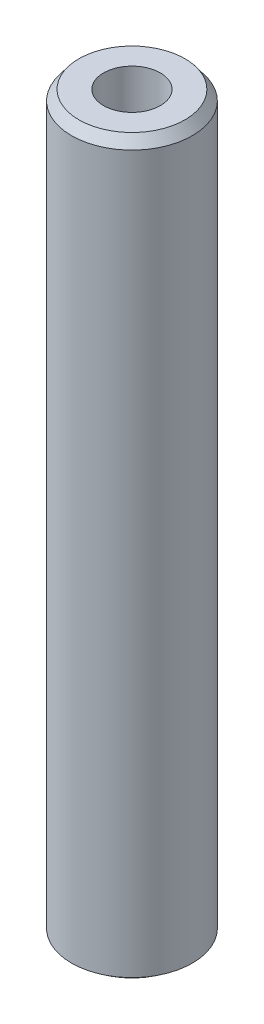
ISO-10303-21;
HEADER;
FILE_DESCRIPTION(('STEP AP214'),'2;1');
FILE_NAME('part.step','',(''),(''),'','','');
FILE_SCHEMA(('AUTOMOTIVE_DESIGN { 1 0 10303 214 1 1 1 1 }'));
ENDSEC;
DATA;
#1=APPLICATION_CONTEXT('core data for automotive mechanical design processes');
#2=APPLICATION_PROTOCOL_DEFINITION('international standard','automotive_design',2000,#1);
#3=PRODUCT_CONTEXT('',#1,'mechanical');
#4=PRODUCT('Part','Part','',(#3));
#5=PRODUCT_RELATED_PRODUCT_CATEGORY('part','',(#4));
#6=PRODUCT_DEFINITION_FORMATION('','',#4);
#7=PRODUCT_DEFINITION_CONTEXT('part definition',#1,'design');
#8=PRODUCT_DEFINITION('design','',#6,#7);
#9=PRODUCT_DEFINITION_SHAPE('','',#8);
#10=(LENGTH_UNIT() NAMED_UNIT(*) SI_UNIT(.MILLI.,.METRE.));
#11=(NAMED_UNIT(*) PLANE_ANGLE_UNIT() SI_UNIT($,.RADIAN.));
#12=(NAMED_UNIT(*) SI_UNIT($,.STERADIAN.) SOLID_ANGLE_UNIT());
#13=UNCERTAINTY_MEASURE_WITH_UNIT(LENGTH_MEASURE(1.E-05),#10,'distance_accuracy_value','');
#14=(GEOMETRIC_REPRESENTATION_CONTEXT(3) GLOBAL_UNCERTAINTY_ASSIGNED_CONTEXT((#13)) GLOBAL_UNIT_ASSIGNED_CONTEXT((#10,
#11,#12)) REPRESENTATION_CONTEXT('',''));
#15=CARTESIAN_POINT('',(0.,0.,0.));
#16=DIRECTION('',(0.,0.,1.));
#17=DIRECTION('',(1.,0.,0.));
#18=AXIS2_PLACEMENT_3D('',#15,#16,#17);
#19=CARTESIAN_POINT('',(0.,303.762270211215,0.));
#20=DIRECTION('',(0.,-1.,0.));
#21=DIRECTION('',(0.,0.,-1.));
#22=AXIS2_PLACEMENT_3D('',#19,#20,#21);
#23=CYLINDRICAL_SURFACE('',#22,25.);
#24=CARTESIAN_POINT('',(0.,299.621065124725,0.));
#25=DIRECTION('',(0.,1.,0.));
#26=DIRECTION('',(0.,0.,1.));
#27=AXIS2_PLACEMENT_3D('',#24,#25,#26);
#28=CIRCLE('',#27,25.);
#29=CARTESIAN_POINT('',(0.,299.621065124725,25.));
#30=VERTEX_POINT('',#29);
#31=EDGE_CURVE('E50',#30,#30,#28,.F.);
#32=ORIENTED_EDGE('',*,*,#31,.T.);
#33=EDGE_LOOP('',(#32));
#34=FACE_BOUND('',#33,.T.);
#35=CARTESIAN_POINT('',(0.,3.07076614439583,0.));
#36=DIRECTION('',(0.,1.,0.));
#37=DIRECTION('',(0.,0.,1.));
#38=AXIS2_PLACEMENT_3D('',#35,#36,#37);
#39=CIRCLE('',#38,25.);
#40=CARTESIAN_POINT('',(0.,3.07076614439583,25.));
#41=VERTEX_POINT('',#40);
#42=EDGE_CURVE('E51',#41,#41,#39,.T.);
#43=ORIENTED_EDGE('',*,*,#42,.T.);
#44=EDGE_LOOP('',(#43));
#45=FACE_BOUND('',#44,.T.);
#46=ADVANCED_FACE('F39',(#34,#45),#23,.T.);
#47=CARTESIAN_POINT('',(0.,303.762270211215,0.));
#48=DIRECTION('',(0.,1.,0.));
#49=DIRECTION('',(0.,0.,1.));
#50=AXIS2_PLACEMENT_3D('',#47,#48,#49);
#51=PLANE('',#50);
#52=CARTESIAN_POINT('',(0.,303.762270211215,0.));
#53=DIRECTION('',(0.,1.,0.));
#54=DIRECTION('',(0.,0.,1.));
#55=AXIS2_PLACEMENT_3D('',#52,#53,#54);
#56=CIRCLE('',#55,21.9292338556043);
#57=CARTESIAN_POINT('',(0.,303.762270211215,21.9292338556043));
#58=VERTEX_POINT('',#57);
#59=EDGE_CURVE('E54',#58,#58,#56,.T.);
#60=ORIENTED_EDGE('',*,*,#59,.T.);
#61=EDGE_LOOP('',(#60));
#62=FACE_BOUND('',#61,.T.);
#63=CARTESIAN_POINT('',(0.,303.762270211215,0.));
#64=DIRECTION('',(0.,1.,0.));
#65=DIRECTION('',(0.,0.,1.));
#66=AXIS2_PLACEMENT_3D('',#63,#64,#65);
#67=CIRCLE('',#66,11.745816581342);
#68=CARTESIAN_POINT('',(0.,303.762270211215,11.745816581342));
#69=VERTEX_POINT('',#68);
#70=EDGE_CURVE('E58',#69,#69,#67,.T.);
#71=ORIENTED_EDGE('',*,*,#70,.F.);
#72=EDGE_LOOP('',(#71));
#73=FACE_BOUND('',#72,.T.);
#74=ADVANCED_FACE('F69',(#62,#73),#51,.T.);
#75=CARTESIAN_POINT('',(0.,0.,0.));
#76=DIRECTION('',(0.,1.,0.));
#77=DIRECTION('',(0.,0.,1.));
#78=AXIS2_PLACEMENT_3D('',#75,#76,#77);
#79=PLANE('',#78);
#80=CARTESIAN_POINT('',(0.,0.,0.));
#81=DIRECTION('',(0.,1.,0.));
#82=DIRECTION('',(0.,0.,1.));
#83=AXIS2_PLACEMENT_3D('',#80,#81,#82);
#84=CIRCLE('',#83,20.8587949135104);
#85=CARTESIAN_POINT('',(0.,0.,20.8587949135104));
#86=VERTEX_POINT('',#85);
#87=EDGE_CURVE('E10',#86,#86,#84,.F.);
#88=ORIENTED_EDGE('',*,*,#87,.T.);
#89=EDGE_LOOP('',(#88));
#90=FACE_BOUND('',#89,.T.);
#91=CARTESIAN_POINT('',(0.,0.,0.));
#92=DIRECTION('',(0.,1.,0.));
#93=DIRECTION('',(0.,0.,1.));
#94=AXIS2_PLACEMENT_3D('',#91,#92,#93);
#95=CIRCLE('',#94,11.745816581342);
#96=CARTESIAN_POINT('',(0.,0.,11.745816581342));
#97=VERTEX_POINT('',#96);
#98=EDGE_CURVE('E63',#97,#97,#95,.T.);
#99=ORIENTED_EDGE('',*,*,#98,.T.);
#100=EDGE_LOOP('',(#99));
#101=FACE_BOUND('',#100,.T.);
#102=ADVANCED_FACE('F75',(#90,#101),#79,.F.);
#103=CARTESIAN_POINT('',(0.,303.762270211215,0.));
#104=DIRECTION('',(0.,-1.,0.));
#105=DIRECTION('',(0.,0.,-1.));
#106=AXIS2_PLACEMENT_3D('',#103,#104,#105);
#107=CYLINDRICAL_SURFACE('',#106,11.745816581342);
#108=ORIENTED_EDGE('',*,*,#70,.T.);
#109=EDGE_LOOP('',(#108));
#110=FACE_BOUND('',#109,.T.);
#111=ORIENTED_EDGE('',*,*,#98,.F.);
#112=EDGE_LOOP('',(#111));
#113=FACE_BOUND('',#112,.T.);
#114=ADVANCED_FACE('F70',(#110,#113),#107,.F.);
#115=CARTESIAN_POINT('',(0.,303.762270211215,0.));
#116=DIRECTION('',(0.,-1.,0.));
#117=DIRECTION('',(0.,0.,-1.));
#118=AXIS2_PLACEMENT_3D('',#115,#116,#117);
#119=CONICAL_SURFACE('',#118,21.9292338556043,0.638048626293196);
#120=ORIENTED_EDGE('',*,*,#31,.F.);
#121=EDGE_LOOP('',(#120));
#122=FACE_BOUND('',#121,.T.);
#123=ORIENTED_EDGE('',*,*,#59,.F.);
#124=EDGE_LOOP('',(#123));
#125=FACE_BOUND('',#124,.T.);
#126=ADVANCED_FACE('F81',(#122,#125),#119,.T.);
#127=CARTESIAN_POINT('',(0.,3.07076614439583,0.));
#128=DIRECTION('',(0.,1.,0.));
#129=DIRECTION('',(0.,0.,1.));
#130=AXIS2_PLACEMENT_3D('',#127,#128,#129);
#131=CONICAL_SURFACE('',#130,25.,0.932747700501698);
#132=ORIENTED_EDGE('',*,*,#87,.F.);
#133=EDGE_LOOP('',(#132));
#134=FACE_BOUND('',#133,.T.);
#135=ORIENTED_EDGE('',*,*,#42,.F.);
#136=EDGE_LOOP('',(#135));
#137=FACE_BOUND('',#136,.T.);
#138=ADVANCED_FACE('F45',(#134,#137),#131,.T.);
#139=CLOSED_SHELL('',(#46,#74,#102,#114,#126,#138));
#140=MANIFOLD_SOLID_BREP('B2',#139);
#141=ADVANCED_BREP_SHAPE_REPRESENTATION('',(#18,#140),#14);
#142=SHAPE_DEFINITION_REPRESENTATION(#9,#141);
ENDSEC;
END-ISO-10303-21;
